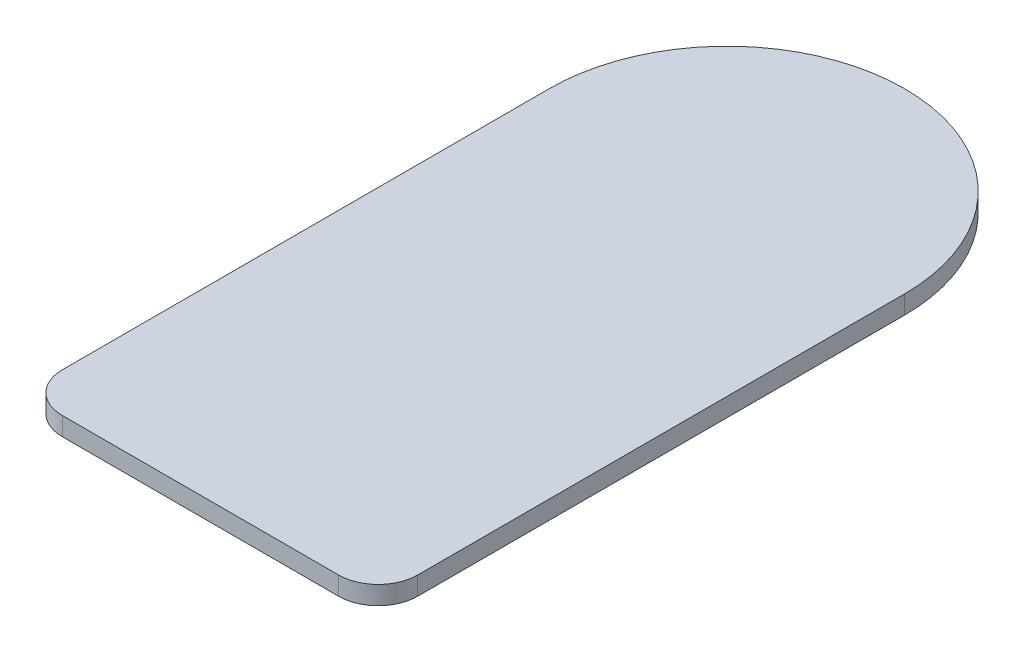
ISO-10303-21;
HEADER;
FILE_DESCRIPTION(('STEP AP214'),'2;1');
FILE_NAME('part.step','',(''),(''),'','','');
FILE_SCHEMA(('AUTOMOTIVE_DESIGN { 1 0 10303 214 1 1 1 1 }'));
ENDSEC;
DATA;
#1=APPLICATION_CONTEXT('core data for automotive mechanical design processes');
#2=APPLICATION_PROTOCOL_DEFINITION('international standard','automotive_design',2000,#1);
#3=PRODUCT_CONTEXT('',#1,'mechanical');
#4=PRODUCT('Part','Part','',(#3));
#5=PRODUCT_RELATED_PRODUCT_CATEGORY('part','',(#4));
#6=PRODUCT_DEFINITION_FORMATION('','',#4);
#7=PRODUCT_DEFINITION_CONTEXT('part definition',#1,'design');
#8=PRODUCT_DEFINITION('design','',#6,#7);
#9=PRODUCT_DEFINITION_SHAPE('','',#8);
#10=(LENGTH_UNIT() NAMED_UNIT(*) SI_UNIT(.MILLI.,.METRE.));
#11=(NAMED_UNIT(*) PLANE_ANGLE_UNIT() SI_UNIT($,.RADIAN.));
#12=(NAMED_UNIT(*) SI_UNIT($,.STERADIAN.) SOLID_ANGLE_UNIT());
#13=UNCERTAINTY_MEASURE_WITH_UNIT(LENGTH_MEASURE(1.E-05),#10,'distance_accuracy_value','');
#14=(GEOMETRIC_REPRESENTATION_CONTEXT(3) GLOBAL_UNCERTAINTY_ASSIGNED_CONTEXT((#13)) GLOBAL_UNIT_ASSIGNED_CONTEXT((#10,
#11,#12)) REPRESENTATION_CONTEXT('',''));
#15=CARTESIAN_POINT('',(0.,0.,0.));
#16=DIRECTION('',(0.,0.,1.));
#17=DIRECTION('',(1.,0.,0.));
#18=AXIS2_PLACEMENT_3D('',#15,#16,#17);
#19=CARTESIAN_POINT('',(-52.5,7.,85.));
#20=DIRECTION('',(0.,-1.,0.));
#21=DIRECTION('',(0.,0.,-1.));
#22=AXIS2_PLACEMENT_3D('',#19,#20,#21);
#23=CYLINDRICAL_SURFACE('',#22,15.);
#24=CARTESIAN_POINT('',(-52.5,0.,85.));
#25=DIRECTION('',(0.,-1.,0.));
#26=DIRECTION('',(0.,0.,-1.));
#27=AXIS2_PLACEMENT_3D('',#24,#25,#26);
#28=CIRCLE('',#27,15.);
#29=CARTESIAN_POINT('',(-52.4999999999999,0.,100.));
#30=VERTEX_POINT('',#29);
#31=CARTESIAN_POINT('',(-67.5,0.,84.9999999999999));
#32=VERTEX_POINT('',#31);
#33=EDGE_CURVE('E129',#30,#32,#28,.T.);
#34=ORIENTED_EDGE('',*,*,#33,.F.);
#35=DIRECTION('',(0.,-1.,0.));
#36=VECTOR('',#35,1.);
#37=CARTESIAN_POINT('',(-52.4999999999999,7.,100.));
#38=LINE('',#37,#36);
#39=CARTESIAN_POINT('',(-52.4999999999999,7.,100.));
#40=VERTEX_POINT('',#39);
#41=EDGE_CURVE('E11',#40,#30,#38,.T.);
#42=ORIENTED_EDGE('',*,*,#41,.F.);
#43=CARTESIAN_POINT('',(-52.5,7.,85.));
#44=DIRECTION('',(0.,-1.,0.));
#45=DIRECTION('',(0.,0.,-1.));
#46=AXIS2_PLACEMENT_3D('',#43,#44,#45);
#47=CIRCLE('',#46,15.);
#48=CARTESIAN_POINT('',(-67.5,7.,84.9999999999999));
#49=VERTEX_POINT('',#48);
#50=EDGE_CURVE('E149',#40,#49,#47,.T.);
#51=ORIENTED_EDGE('',*,*,#50,.T.);
#52=DIRECTION('',(0.,-1.,0.));
#53=VECTOR('',#52,1.);
#54=CARTESIAN_POINT('',(-67.5,7.,84.9999999999999));
#55=LINE('',#54,#53);
#56=EDGE_CURVE('E42',#49,#32,#55,.T.);
#57=ORIENTED_EDGE('',*,*,#56,.T.);
#58=EDGE_LOOP('',(#34,#42,#51,#57));
#59=FACE_BOUND('',#58,.T.);
#60=ADVANCED_FACE('F39',(#59),#23,.T.);
#61=CARTESIAN_POINT('',(52.4999999999999,7.,100.));
#62=DIRECTION('',(0.,0.,1.));
#63=DIRECTION('',(1.,0.,0.));
#64=AXIS2_PLACEMENT_3D('',#61,#62,#63);
#65=PLANE('',#64);
#66=DIRECTION('',(-1.,0.,0.));
#67=VECTOR('',#66,1.);
#68=CARTESIAN_POINT('',(52.4999999999999,0.,100.));
#69=LINE('',#68,#67);
#70=CARTESIAN_POINT('',(52.4999999999999,0.,100.));
#71=VERTEX_POINT('',#70);
#72=EDGE_CURVE('E146',#71,#30,#69,.T.);
#73=ORIENTED_EDGE('',*,*,#72,.F.);
#74=DIRECTION('',(0.,-1.,0.));
#75=VECTOR('',#74,1.);
#76=CARTESIAN_POINT('',(52.4999999999999,7.,100.));
#77=LINE('',#76,#75);
#78=CARTESIAN_POINT('',(52.4999999999999,7.,100.));
#79=VERTEX_POINT('',#78);
#80=EDGE_CURVE('E49',#79,#71,#77,.T.);
#81=ORIENTED_EDGE('',*,*,#80,.F.);
#82=DIRECTION('',(-1.,0.,0.));
#83=VECTOR('',#82,1.);
#84=CARTESIAN_POINT('',(52.4999999999999,7.,100.));
#85=LINE('',#84,#83);
#86=EDGE_CURVE('E104',#79,#40,#85,.T.);
#87=ORIENTED_EDGE('',*,*,#86,.T.);
#88=ORIENTED_EDGE('',*,*,#41,.T.);
#89=EDGE_LOOP('',(#73,#81,#87,#88));
#90=FACE_BOUND('',#89,.T.);
#91=ADVANCED_FACE('F162',(#90),#65,.T.);
#92=CARTESIAN_POINT('',(52.5,7.,85.));
#93=DIRECTION('',(0.,-1.,0.));
#94=DIRECTION('',(0.,0.,-1.));
#95=AXIS2_PLACEMENT_3D('',#92,#93,#94);
#96=CYLINDRICAL_SURFACE('',#95,15.);
#97=CARTESIAN_POINT('',(52.5,0.,85.));
#98=DIRECTION('',(0.,1.,0.));
#99=DIRECTION('',(0.,0.,1.));
#100=AXIS2_PLACEMENT_3D('',#97,#98,#99);
#101=CIRCLE('',#100,15.);
#102=CARTESIAN_POINT('',(67.5,0.,84.9999999999999));
#103=VERTEX_POINT('',#102);
#104=EDGE_CURVE('E110',#71,#103,#101,.T.);
#105=ORIENTED_EDGE('',*,*,#104,.T.);
#106=DIRECTION('',(0.,-1.,0.));
#107=VECTOR('',#106,1.);
#108=CARTESIAN_POINT('',(67.5,7.,84.9999999999999));
#109=LINE('',#108,#107);
#110=CARTESIAN_POINT('',(67.5,7.,84.9999999999999));
#111=VERTEX_POINT('',#110);
#112=EDGE_CURVE('E108',#111,#103,#109,.T.);
#113=ORIENTED_EDGE('',*,*,#112,.F.);
#114=CARTESIAN_POINT('',(52.5,7.,85.));
#115=DIRECTION('',(0.,1.,0.));
#116=DIRECTION('',(0.,0.,1.));
#117=AXIS2_PLACEMENT_3D('',#114,#115,#116);
#118=CIRCLE('',#117,15.);
#119=EDGE_CURVE('E98',#79,#111,#118,.T.);
#120=ORIENTED_EDGE('',*,*,#119,.F.);
#121=ORIENTED_EDGE('',*,*,#80,.T.);
#122=EDGE_LOOP('',(#105,#113,#120,#121));
#123=FACE_BOUND('',#122,.T.);
#124=ADVANCED_FACE('F109',(#123),#96,.T.);
#125=CARTESIAN_POINT('',(67.5,7.,84.9999999999999));
#126=DIRECTION('',(-1.,0.,0.));
#127=DIRECTION('',(0.,0.,1.));
#128=AXIS2_PLACEMENT_3D('',#125,#126,#127);
#129=PLANE('',#128);
#130=DIRECTION('',(0.,0.,-1.));
#131=VECTOR('',#130,1.);
#132=CARTESIAN_POINT('',(67.5,0.,84.9999999999999));
#133=LINE('',#132,#131);
#134=CARTESIAN_POINT('',(67.5,0.,-100.));
#135=VERTEX_POINT('',#134);
#136=EDGE_CURVE('E141',#103,#135,#133,.T.);
#137=ORIENTED_EDGE('',*,*,#136,.T.);
#138=DIRECTION('',(0.,-1.,0.));
#139=VECTOR('',#138,1.);
#140=CARTESIAN_POINT('',(67.5,7.,-100.));
#141=LINE('',#140,#139);
#142=CARTESIAN_POINT('',(67.5,7.,-100.));
#143=VERTEX_POINT('',#142);
#144=EDGE_CURVE('E114',#143,#135,#141,.T.);
#145=ORIENTED_EDGE('',*,*,#144,.F.);
#146=DIRECTION('',(0.,0.,-1.));
#147=VECTOR('',#146,1.);
#148=CARTESIAN_POINT('',(67.5,7.,84.9999999999999));
#149=LINE('',#148,#147);
#150=EDGE_CURVE('E102',#111,#143,#149,.T.);
#151=ORIENTED_EDGE('',*,*,#150,.F.);
#152=ORIENTED_EDGE('',*,*,#112,.T.);
#153=EDGE_LOOP('',(#137,#145,#151,#152));
#154=FACE_BOUND('',#153,.T.);
#155=ADVANCED_FACE('F116',(#154),#129,.F.);
#156=CARTESIAN_POINT('',(0.,7.,-100.));
#157=DIRECTION('',(0.,-1.,0.));
#158=DIRECTION('',(0.,0.,-1.));
#159=AXIS2_PLACEMENT_3D('',#156,#157,#158);
#160=CYLINDRICAL_SURFACE('',#159,67.5);
#161=CARTESIAN_POINT('',(0.,0.,-100.));
#162=DIRECTION('',(0.,1.,0.));
#163=DIRECTION('',(0.,0.,1.));
#164=AXIS2_PLACEMENT_3D('',#161,#162,#163);
#165=CIRCLE('',#164,67.5);
#166=CARTESIAN_POINT('',(-67.5,0.,-100.));
#167=VERTEX_POINT('',#166);
#168=EDGE_CURVE('E137',#135,#167,#165,.T.);
#169=ORIENTED_EDGE('',*,*,#168,.T.);
#170=DIRECTION('',(0.,-1.,0.));
#171=VECTOR('',#170,1.);
#172=CARTESIAN_POINT('',(-67.5,7.,-100.));
#173=LINE('',#172,#171);
#174=CARTESIAN_POINT('',(-67.5,7.,-100.));
#175=VERTEX_POINT('',#174);
#176=EDGE_CURVE('E154',#175,#167,#173,.T.);
#177=ORIENTED_EDGE('',*,*,#176,.F.);
#178=CARTESIAN_POINT('',(0.,7.,-100.));
#179=DIRECTION('',(0.,1.,0.));
#180=DIRECTION('',(0.,0.,1.));
#181=AXIS2_PLACEMENT_3D('',#178,#179,#180);
#182=CIRCLE('',#181,67.5);
#183=EDGE_CURVE('E120',#143,#175,#182,.T.);
#184=ORIENTED_EDGE('',*,*,#183,.F.);
#185=ORIENTED_EDGE('',*,*,#144,.T.);
#186=EDGE_LOOP('',(#169,#177,#184,#185));
#187=FACE_BOUND('',#186,.T.);
#188=ADVANCED_FACE('F175',(#187),#160,.T.);
#189=CARTESIAN_POINT('',(-67.5,7.,84.9999999999999));
#190=DIRECTION('',(-1.,0.,0.));
#191=DIRECTION('',(0.,0.,1.));
#192=AXIS2_PLACEMENT_3D('',#189,#190,#191);
#193=PLANE('',#192);
#194=DIRECTION('',(0.,0.,-1.));
#195=VECTOR('',#194,1.);
#196=CARTESIAN_POINT('',(-67.5,0.,84.9999999999999));
#197=LINE('',#196,#195);
#198=EDGE_CURVE('E133',#32,#167,#197,.T.);
#199=ORIENTED_EDGE('',*,*,#198,.F.);
#200=ORIENTED_EDGE('',*,*,#56,.F.);
#201=DIRECTION('',(0.,0.,-1.));
#202=VECTOR('',#201,1.);
#203=CARTESIAN_POINT('',(-67.5,7.,84.9999999999999));
#204=LINE('',#203,#202);
#205=EDGE_CURVE('E123',#49,#175,#204,.T.);
#206=ORIENTED_EDGE('',*,*,#205,.T.);
#207=ORIENTED_EDGE('',*,*,#176,.T.);
#208=EDGE_LOOP('',(#199,#200,#206,#207));
#209=FACE_BOUND('',#208,.T.);
#210=ADVANCED_FACE('F158',(#209),#193,.T.);
#211=CARTESIAN_POINT('',(-52.5,7.,85.));
#212=DIRECTION('',(0.,-1.,0.));
#213=DIRECTION('',(0.,0.,-1.));
#214=AXIS2_PLACEMENT_3D('',#211,#212,#213);
#215=PLANE('',#214);
#216=ORIENTED_EDGE('',*,*,#50,.F.);
#217=ORIENTED_EDGE('',*,*,#86,.F.);
#218=ORIENTED_EDGE('',*,*,#119,.T.);
#219=ORIENTED_EDGE('',*,*,#150,.T.);
#220=ORIENTED_EDGE('',*,*,#183,.T.);
#221=ORIENTED_EDGE('',*,*,#205,.F.);
#222=EDGE_LOOP('',(#216,#217,#218,#219,#220,#221));
#223=FACE_BOUND('',#222,.T.);
#224=ADVANCED_FACE('F100',(#223),#215,.F.);
#225=CARTESIAN_POINT('',(-52.5,0.,85.));
#226=DIRECTION('',(0.,-1.,0.));
#227=DIRECTION('',(0.,0.,-1.));
#228=AXIS2_PLACEMENT_3D('',#225,#226,#227);
#229=PLANE('',#228);
#230=ORIENTED_EDGE('',*,*,#33,.T.);
#231=ORIENTED_EDGE('',*,*,#198,.T.);
#232=ORIENTED_EDGE('',*,*,#168,.F.);
#233=ORIENTED_EDGE('',*,*,#136,.F.);
#234=ORIENTED_EDGE('',*,*,#104,.F.);
#235=ORIENTED_EDGE('',*,*,#72,.T.);
#236=EDGE_LOOP('',(#230,#231,#232,#233,#234,#235));
#237=FACE_BOUND('',#236,.T.);
#238=ADVANCED_FACE('F161',(#237),#229,.T.);
#239=CLOSED_SHELL('',(#60,#91,#124,#155,#188,#210,#224,#238));
#240=MANIFOLD_SOLID_BREP('B2',#239);
#241=ADVANCED_BREP_SHAPE_REPRESENTATION('',(#18,#240),#14);
#242=SHAPE_DEFINITION_REPRESENTATION(#9,#241);
ENDSEC;
END-ISO-10303-21;
